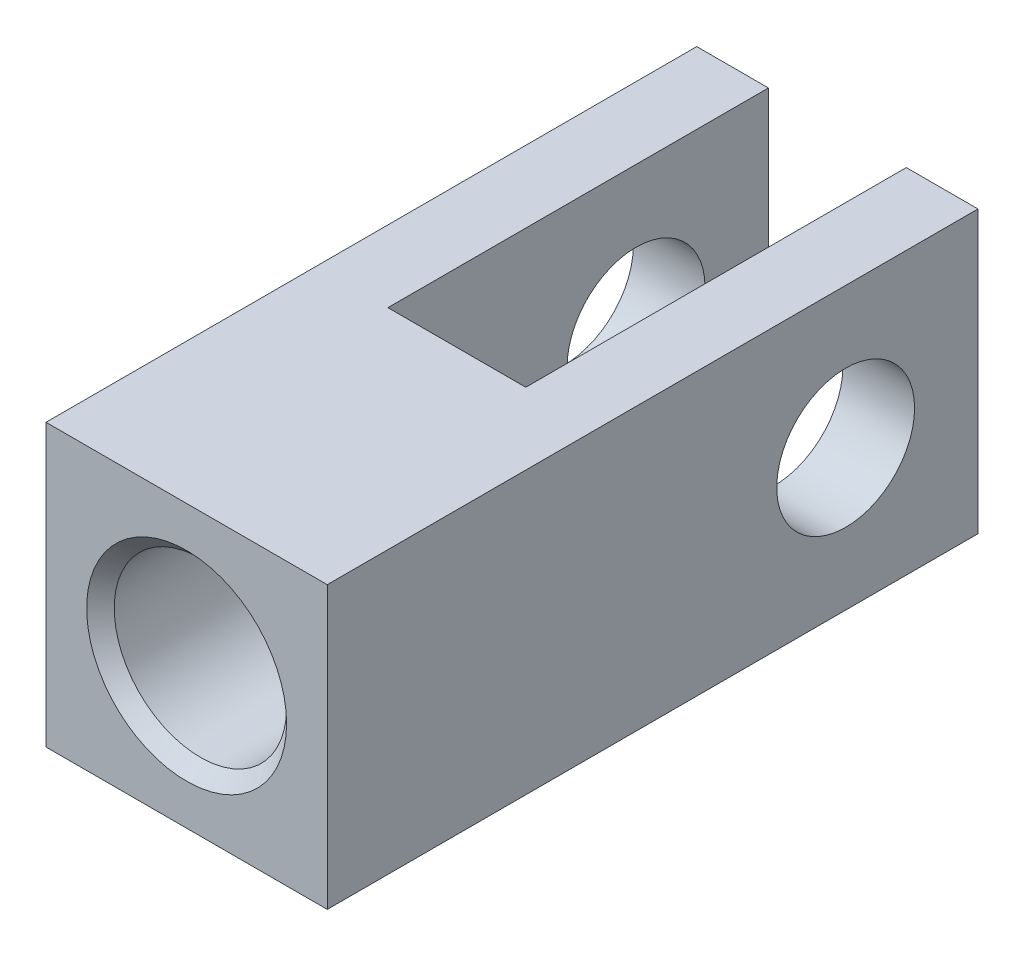
ISO-10303-21;
HEADER;
FILE_DESCRIPTION(('STEP AP214'),'2;1');
FILE_NAME('part.step','',(''),(''),'','','');
FILE_SCHEMA(('AUTOMOTIVE_DESIGN { 1 0 10303 214 1 1 1 1 }'));
ENDSEC;
DATA;
#1=APPLICATION_CONTEXT('core data for automotive mechanical design processes');
#2=APPLICATION_PROTOCOL_DEFINITION('international standard','automotive_design',2000,#1);
#3=PRODUCT_CONTEXT('',#1,'mechanical');
#4=PRODUCT('Part','Part','',(#3));
#5=PRODUCT_RELATED_PRODUCT_CATEGORY('part','',(#4));
#6=PRODUCT_DEFINITION_FORMATION('','',#4);
#7=PRODUCT_DEFINITION_CONTEXT('part definition',#1,'design');
#8=PRODUCT_DEFINITION('design','',#6,#7);
#9=PRODUCT_DEFINITION_SHAPE('','',#8);
#10=(LENGTH_UNIT() NAMED_UNIT(*) SI_UNIT(.MILLI.,.METRE.));
#11=(NAMED_UNIT(*) PLANE_ANGLE_UNIT() SI_UNIT($,.RADIAN.));
#12=(NAMED_UNIT(*) SI_UNIT($,.STERADIAN.) SOLID_ANGLE_UNIT());
#13=UNCERTAINTY_MEASURE_WITH_UNIT(LENGTH_MEASURE(1.E-05),#10,'distance_accuracy_value','');
#14=(GEOMETRIC_REPRESENTATION_CONTEXT(3) GLOBAL_UNCERTAINTY_ASSIGNED_CONTEXT((#13)) GLOBAL_UNIT_ASSIGNED_CONTEXT((#10,
#11,#12)) REPRESENTATION_CONTEXT('',''));
#15=CARTESIAN_POINT('',(0.,0.,0.));
#16=DIRECTION('',(0.,0.,1.));
#17=DIRECTION('',(1.,0.,0.));
#18=AXIS2_PLACEMENT_3D('',#15,#16,#17);
#19=CARTESIAN_POINT('',(-3.175,-6.477,2.54));
#20=DIRECTION('',(0.,0.,1.));
#21=DIRECTION('',(1.,0.,0.));
#22=AXIS2_PLACEMENT_3D('',#19,#20,#21);
#23=PLANE('',#22);
#24=DIRECTION('',(0.,1.,0.));
#25=VECTOR('',#24,1.);
#26=CARTESIAN_POINT('',(3.175,-6.477,2.54));
#27=LINE('',#26,#25);
#28=CARTESIAN_POINT('',(3.175,2.38124999999999,2.54));
#29=VERTEX_POINT('',#28);
#30=CARTESIAN_POINT('',(3.175,6.477,2.54));
#31=VERTEX_POINT('',#30);
#32=EDGE_CURVE('E126',#29,#31,#27,.T.);
#33=ORIENTED_EDGE('',*,*,#32,.F.);
#34=CARTESIAN_POINT('',(0.,0.,2.54));
#35=DIRECTION('',(0.,0.,1.));
#36=DIRECTION('',(1.,0.,0.));
#37=AXIS2_PLACEMENT_3D('',#34,#35,#36);
#38=CIRCLE('',#37,3.96875);
#39=CARTESIAN_POINT('',(-3.175,2.38125,2.54));
#40=VERTEX_POINT('',#39);
#41=EDGE_CURVE('E11',#29,#40,#38,.T.);
#42=ORIENTED_EDGE('',*,*,#41,.T.);
#43=DIRECTION('',(0.,1.,0.));
#44=VECTOR('',#43,1.);
#45=CARTESIAN_POINT('',(-3.175,-6.477,2.54));
#46=LINE('',#45,#44);
#47=CARTESIAN_POINT('',(-3.175,6.477,2.54));
#48=VERTEX_POINT('',#47);
#49=EDGE_CURVE('E141',#40,#48,#46,.T.);
#50=ORIENTED_EDGE('',*,*,#49,.T.);
#51=DIRECTION('',(1.,0.,0.));
#52=VECTOR('',#51,1.);
#53=CARTESIAN_POINT('',(-3.175,6.477,2.54));
#54=LINE('',#53,#52);
#55=EDGE_CURVE('E128',#48,#31,#54,.T.);
#56=ORIENTED_EDGE('',*,*,#55,.T.);
#57=EDGE_LOOP('',(#33,#42,#50,#56));
#58=FACE_BOUND('',#57,.T.);
#59=ADVANCED_FACE('F35',(#58),#23,.F.);
#60=CARTESIAN_POINT('',(6.477,6.477,-14.986));
#61=DIRECTION('',(0.,0.,1.));
#62=DIRECTION('',(1.,0.,0.));
#63=AXIS2_PLACEMENT_3D('',#60,#61,#62);
#64=PLANE('',#63);
#65=DIRECTION('',(-1.,0.,0.));
#66=VECTOR('',#65,1.);
#67=CARTESIAN_POINT('',(6.477,6.477,-14.986));
#68=LINE('',#67,#66);
#69=CARTESIAN_POINT('',(-3.175,6.477,-14.986));
#70=VERTEX_POINT('',#69);
#71=CARTESIAN_POINT('',(-6.477,6.477,-14.986));
#72=VERTEX_POINT('',#71);
#73=EDGE_CURVE('E150',#70,#72,#68,.T.);
#74=ORIENTED_EDGE('',*,*,#73,.F.);
#75=DIRECTION('',(0.,1.,0.));
#76=VECTOR('',#75,1.);
#77=CARTESIAN_POINT('',(-3.175,-6.477,-14.986));
#78=LINE('',#77,#76);
#79=CARTESIAN_POINT('',(-3.175,-6.477,-14.986));
#80=VERTEX_POINT('',#79);
#81=EDGE_CURVE('E159',#80,#70,#78,.T.);
#82=ORIENTED_EDGE('',*,*,#81,.F.);
#83=DIRECTION('',(-1.,0.,0.));
#84=VECTOR('',#83,1.);
#85=CARTESIAN_POINT('',(6.477,-6.477,-14.986));
#86=LINE('',#85,#84);
#87=CARTESIAN_POINT('',(-6.477,-6.477,-14.986));
#88=VERTEX_POINT('',#87);
#89=EDGE_CURVE('E163',#80,#88,#86,.T.);
#90=ORIENTED_EDGE('',*,*,#89,.T.);
#91=DIRECTION('',(0.,-1.,0.));
#92=VECTOR('',#91,1.);
#93=CARTESIAN_POINT('',(-6.477,6.477,-14.986));
#94=LINE('',#93,#92);
#95=EDGE_CURVE('E154',#72,#88,#94,.T.);
#96=ORIENTED_EDGE('',*,*,#95,.F.);
#97=EDGE_LOOP('',(#74,#82,#90,#96));
#98=FACE_BOUND('',#97,.T.);
#99=ADVANCED_FACE('F234',(#98),#64,.F.);
#100=CARTESIAN_POINT('',(-6.477,6.477,14.986));
#101=DIRECTION('',(1.,0.,0.));
#102=DIRECTION('',(0.,0.,-1.));
#103=AXIS2_PLACEMENT_3D('',#100,#101,#102);
#104=PLANE('',#103);
#105=CARTESIAN_POINT('',(-6.477,0.,-8.89));
#106=DIRECTION('',(1.,0.,0.));
#107=DIRECTION('',(0.,0.,-1.));
#108=AXIS2_PLACEMENT_3D('',#105,#106,#107);
#109=CIRCLE('',#108,3.175);
#110=CARTESIAN_POINT('',(-6.477,0.,-12.065));
#111=VERTEX_POINT('',#110);
#112=EDGE_CURVE('E179',#111,#111,#109,.T.);
#113=ORIENTED_EDGE('',*,*,#112,.T.);
#114=EDGE_LOOP('',(#113));
#115=FACE_BOUND('',#114,.T.);
#116=DIRECTION('',(0.,0.,1.));
#117=VECTOR('',#116,1.);
#118=CARTESIAN_POINT('',(-6.477,-6.477,14.986));
#119=LINE('',#118,#117);
#120=CARTESIAN_POINT('',(-6.477,-6.477,14.986));
#121=VERTEX_POINT('',#120);
#122=EDGE_CURVE('E155',#88,#121,#119,.T.);
#123=ORIENTED_EDGE('',*,*,#122,.T.);
#124=DIRECTION('',(0.,-1.,0.));
#125=VECTOR('',#124,1.);
#126=CARTESIAN_POINT('',(-6.477,6.477,14.986));
#127=LINE('',#126,#125);
#128=CARTESIAN_POINT('',(-6.477,6.477,14.986));
#129=VERTEX_POINT('',#128);
#130=EDGE_CURVE('E174',#129,#121,#127,.T.);
#131=ORIENTED_EDGE('',*,*,#130,.F.);
#132=DIRECTION('',(0.,0.,1.));
#133=VECTOR('',#132,1.);
#134=CARTESIAN_POINT('',(-6.477,6.477,14.986));
#135=LINE('',#134,#133);
#136=EDGE_CURVE('E142',#72,#129,#135,.T.);
#137=ORIENTED_EDGE('',*,*,#136,.F.);
#138=ORIENTED_EDGE('',*,*,#95,.T.);
#139=EDGE_LOOP('',(#123,#131,#137,#138));
#140=FACE_BOUND('',#139,.T.);
#141=ADVANCED_FACE('F37',(#115,#140),#104,.F.);
#142=CARTESIAN_POINT('',(6.477,6.477,14.986));
#143=DIRECTION('',(0.,0.,-1.));
#144=DIRECTION('',(-1.,0.,0.));
#145=AXIS2_PLACEMENT_3D('',#142,#143,#144);
#146=PLANE('',#145);
#147=CARTESIAN_POINT('',(0.,0.,14.986));
#148=DIRECTION('',(0.,0.,1.));
#149=DIRECTION('',(1.,0.,0.));
#150=AXIS2_PLACEMENT_3D('',#147,#148,#149);
#151=CIRCLE('',#150,4.60375);
#152=CARTESIAN_POINT('',(4.60375,0.,14.986));
#153=VERTEX_POINT('',#152);
#154=EDGE_CURVE('E385',#153,#153,#151,.T.);
#155=ORIENTED_EDGE('',*,*,#154,.F.);
#156=EDGE_LOOP('',(#155));
#157=FACE_BOUND('',#156,.T.);
#158=DIRECTION('',(1.,0.,0.));
#159=VECTOR('',#158,1.);
#160=CARTESIAN_POINT('',(6.477,-6.477,14.986));
#161=LINE('',#160,#159);
#162=CARTESIAN_POINT('',(6.477,-6.477,14.986));
#163=VERTEX_POINT('',#162);
#164=EDGE_CURVE('E158',#121,#163,#161,.T.);
#165=ORIENTED_EDGE('',*,*,#164,.T.);
#166=DIRECTION('',(0.,-1.,0.));
#167=VECTOR('',#166,1.);
#168=CARTESIAN_POINT('',(6.477,6.477,14.986));
#169=LINE('',#168,#167);
#170=CARTESIAN_POINT('',(6.477,6.477,14.986));
#171=VERTEX_POINT('',#170);
#172=EDGE_CURVE('E171',#171,#163,#169,.T.);
#173=ORIENTED_EDGE('',*,*,#172,.F.);
#174=DIRECTION('',(1.,0.,0.));
#175=VECTOR('',#174,1.);
#176=CARTESIAN_POINT('',(6.477,6.477,14.986));
#177=LINE('',#176,#175);
#178=EDGE_CURVE('E145',#129,#171,#177,.T.);
#179=ORIENTED_EDGE('',*,*,#178,.F.);
#180=ORIENTED_EDGE('',*,*,#130,.T.);
#181=EDGE_LOOP('',(#165,#173,#179,#180));
#182=FACE_BOUND('',#181,.T.);
#183=ADVANCED_FACE('F240',(#157,#182),#146,.F.);
#184=CARTESIAN_POINT('',(6.477,6.477,14.986));
#185=DIRECTION('',(-1.,0.,0.));
#186=DIRECTION('',(0.,0.,1.));
#187=AXIS2_PLACEMENT_3D('',#184,#185,#186);
#188=PLANE('',#187);
#189=CARTESIAN_POINT('',(6.477,0.,-8.89));
#190=DIRECTION('',(1.,0.,0.));
#191=DIRECTION('',(0.,0.,-1.));
#192=AXIS2_PLACEMENT_3D('',#189,#190,#191);
#193=CIRCLE('',#192,3.175);
#194=CARTESIAN_POINT('',(6.477,0.,-12.065));
#195=VERTEX_POINT('',#194);
#196=EDGE_CURVE('E123',#195,#195,#193,.T.);
#197=ORIENTED_EDGE('',*,*,#196,.F.);
#198=EDGE_LOOP('',(#197));
#199=FACE_BOUND('',#198,.T.);
#200=DIRECTION('',(0.,0.,-1.));
#201=VECTOR('',#200,1.);
#202=CARTESIAN_POINT('',(6.477,-6.477,14.986));
#203=LINE('',#202,#201);
#204=CARTESIAN_POINT('',(6.477,-6.477,-14.986));
#205=VERTEX_POINT('',#204);
#206=EDGE_CURVE('E161',#163,#205,#203,.T.);
#207=ORIENTED_EDGE('',*,*,#206,.T.);
#208=DIRECTION('',(0.,-1.,0.));
#209=VECTOR('',#208,1.);
#210=CARTESIAN_POINT('',(6.477,6.477,-14.986));
#211=LINE('',#210,#209);
#212=CARTESIAN_POINT('',(6.477,6.477,-14.986));
#213=VERTEX_POINT('',#212);
#214=EDGE_CURVE('E168',#213,#205,#211,.T.);
#215=ORIENTED_EDGE('',*,*,#214,.F.);
#216=DIRECTION('',(0.,0.,-1.));
#217=VECTOR('',#216,1.);
#218=CARTESIAN_POINT('',(6.477,6.477,14.986));
#219=LINE('',#218,#217);
#220=EDGE_CURVE('E148',#171,#213,#219,.T.);
#221=ORIENTED_EDGE('',*,*,#220,.F.);
#222=ORIENTED_EDGE('',*,*,#172,.T.);
#223=EDGE_LOOP('',(#207,#215,#221,#222));
#224=FACE_BOUND('',#223,.T.);
#225=ADVANCED_FACE('F218',(#199,#224),#188,.F.);
#226=CARTESIAN_POINT('',(3.175,-6.477,-14.986));
#227=VERTEX_POINT('',#226);
#228=EDGE_CURVE('E146',#205,#227,#86,.T.);
#229=ORIENTED_EDGE('',*,*,#228,.T.);
#230=DIRECTION('',(0.,1.,0.));
#231=VECTOR('',#230,1.);
#232=CARTESIAN_POINT('',(3.175,-6.477,-14.986));
#233=LINE('',#232,#231);
#234=CARTESIAN_POINT('',(3.175,6.477,-14.986));
#235=VERTEX_POINT('',#234);
#236=EDGE_CURVE('E134',#227,#235,#233,.T.);
#237=ORIENTED_EDGE('',*,*,#236,.T.);
#238=EDGE_CURVE('E151',#213,#235,#68,.T.);
#239=ORIENTED_EDGE('',*,*,#238,.F.);
#240=ORIENTED_EDGE('',*,*,#214,.T.);
#241=EDGE_LOOP('',(#229,#237,#239,#240));
#242=FACE_BOUND('',#241,.T.);
#243=ADVANCED_FACE('F210',(#242),#64,.F.);
#244=CARTESIAN_POINT('',(-6.477,6.477,-14.986));
#245=DIRECTION('',(0.,1.,0.));
#246=DIRECTION('',(0.,0.,1.));
#247=AXIS2_PLACEMENT_3D('',#244,#245,#246);
#248=PLANE('',#247);
#249=DIRECTION('',(0.,0.,1.));
#250=VECTOR('',#249,1.);
#251=CARTESIAN_POINT('',(-3.175,6.477,-14.986));
#252=LINE('',#251,#250);
#253=EDGE_CURVE('E183',#70,#48,#252,.T.);
#254=ORIENTED_EDGE('',*,*,#253,.F.);
#255=ORIENTED_EDGE('',*,*,#73,.T.);
#256=ORIENTED_EDGE('',*,*,#136,.T.);
#257=ORIENTED_EDGE('',*,*,#178,.T.);
#258=ORIENTED_EDGE('',*,*,#220,.T.);
#259=ORIENTED_EDGE('',*,*,#238,.T.);
#260=DIRECTION('',(0.,0.,-1.));
#261=VECTOR('',#260,1.);
#262=CARTESIAN_POINT('',(3.175,6.477,-14.986));
#263=LINE('',#262,#261);
#264=EDGE_CURVE('E197',#31,#235,#263,.T.);
#265=ORIENTED_EDGE('',*,*,#264,.F.);
#266=ORIENTED_EDGE('',*,*,#55,.F.);
#267=EDGE_LOOP('',(#254,#255,#256,#257,#258,#259,#265,#266));
#268=FACE_BOUND('',#267,.T.);
#269=ADVANCED_FACE('F213',(#268),#248,.T.);
#270=CARTESIAN_POINT('',(-6.477,-6.477,-14.986));
#271=DIRECTION('',(0.,1.,0.));
#272=DIRECTION('',(0.,0.,1.));
#273=AXIS2_PLACEMENT_3D('',#270,#271,#272);
#274=PLANE('',#273);
#275=ORIENTED_EDGE('',*,*,#89,.F.);
#276=DIRECTION('',(0.,0.,1.));
#277=VECTOR('',#276,1.);
#278=CARTESIAN_POINT('',(-3.175,-6.477,-14.986));
#279=LINE('',#278,#277);
#280=CARTESIAN_POINT('',(-3.175,-6.477,2.54));
#281=VERTEX_POINT('',#280);
#282=EDGE_CURVE('E193',#80,#281,#279,.T.);
#283=ORIENTED_EDGE('',*,*,#282,.T.);
#284=DIRECTION('',(1.,0.,0.));
#285=VECTOR('',#284,1.);
#286=CARTESIAN_POINT('',(-3.175,-6.477,2.54));
#287=LINE('',#286,#285);
#288=CARTESIAN_POINT('',(3.175,-6.477,2.54));
#289=VERTEX_POINT('',#288);
#290=EDGE_CURVE('E196',#281,#289,#287,.T.);
#291=ORIENTED_EDGE('',*,*,#290,.T.);
#292=DIRECTION('',(0.,0.,-1.));
#293=VECTOR('',#292,1.);
#294=CARTESIAN_POINT('',(3.175,-6.477,-14.986));
#295=LINE('',#294,#293);
#296=EDGE_CURVE('E58',#289,#227,#295,.T.);
#297=ORIENTED_EDGE('',*,*,#296,.T.);
#298=ORIENTED_EDGE('',*,*,#228,.F.);
#299=ORIENTED_EDGE('',*,*,#206,.F.);
#300=ORIENTED_EDGE('',*,*,#164,.F.);
#301=ORIENTED_EDGE('',*,*,#122,.F.);
#302=EDGE_LOOP('',(#275,#283,#291,#297,#298,#299,#300,#301));
#303=FACE_BOUND('',#302,.T.);
#304=ADVANCED_FACE('F222',(#303),#274,.F.);
#305=CARTESIAN_POINT('',(-3.175,-6.477,-14.986));
#306=DIRECTION('',(-1.,0.,0.));
#307=DIRECTION('',(0.,0.,1.));
#308=AXIS2_PLACEMENT_3D('',#305,#306,#307);
#309=PLANE('',#308);
#310=CARTESIAN_POINT('',(-3.175,0.,-8.89));
#311=DIRECTION('',(-1.,0.,0.));
#312=DIRECTION('',(0.,0.,1.));
#313=AXIS2_PLACEMENT_3D('',#310,#311,#312);
#314=CIRCLE('',#313,3.175);
#315=CARTESIAN_POINT('',(-3.175,0.,-5.715));
#316=VERTEX_POINT('',#315);
#317=EDGE_CURVE('E178',#316,#316,#314,.T.);
#318=ORIENTED_EDGE('',*,*,#317,.T.);
#319=EDGE_LOOP('',(#318));
#320=FACE_BOUND('',#319,.T.);
#321=ORIENTED_EDGE('',*,*,#253,.T.);
#322=ORIENTED_EDGE('',*,*,#49,.F.);
#323=CARTESIAN_POINT('',(-3.175,-2.38125,2.54));
#324=VERTEX_POINT('',#323);
#325=EDGE_CURVE('E140',#324,#40,#46,.T.);
#326=ORIENTED_EDGE('',*,*,#325,.F.);
#327=EDGE_CURVE('E130',#281,#324,#46,.T.);
#328=ORIENTED_EDGE('',*,*,#327,.F.);
#329=ORIENTED_EDGE('',*,*,#282,.F.);
#330=ORIENTED_EDGE('',*,*,#81,.T.);
#331=EDGE_LOOP('',(#321,#322,#326,#328,#329,#330));
#332=FACE_BOUND('',#331,.T.);
#333=ADVANCED_FACE('F230',(#320,#332),#309,.F.);
#334=CARTESIAN_POINT('',(3.175,-6.477,-14.986));
#335=DIRECTION('',(1.,0.,0.));
#336=DIRECTION('',(0.,0.,-1.));
#337=AXIS2_PLACEMENT_3D('',#334,#335,#336);
#338=PLANE('',#337);
#339=CARTESIAN_POINT('',(3.175,0.,-8.89));
#340=DIRECTION('',(1.,0.,0.));
#341=DIRECTION('',(0.,0.,-1.));
#342=AXIS2_PLACEMENT_3D('',#339,#340,#341);
#343=CIRCLE('',#342,3.175);
#344=CARTESIAN_POINT('',(3.175,0.,-12.065));
#345=VERTEX_POINT('',#344);
#346=EDGE_CURVE('E176',#345,#345,#343,.T.);
#347=ORIENTED_EDGE('',*,*,#346,.T.);
#348=EDGE_LOOP('',(#347));
#349=FACE_BOUND('',#348,.T.);
#350=ORIENTED_EDGE('',*,*,#264,.T.);
#351=ORIENTED_EDGE('',*,*,#236,.F.);
#352=ORIENTED_EDGE('',*,*,#296,.F.);
#353=CARTESIAN_POINT('',(3.175,-2.38124999999999,2.54));
#354=VERTEX_POINT('',#353);
#355=EDGE_CURVE('E132',#289,#354,#27,.T.);
#356=ORIENTED_EDGE('',*,*,#355,.T.);
#357=EDGE_CURVE('E122',#354,#29,#27,.T.);
#358=ORIENTED_EDGE('',*,*,#357,.T.);
#359=ORIENTED_EDGE('',*,*,#32,.T.);
#360=EDGE_LOOP('',(#350,#351,#352,#356,#358,#359));
#361=FACE_BOUND('',#360,.T.);
#362=ADVANCED_FACE('F133',(#349,#361),#338,.F.);
#363=ORIENTED_EDGE('',*,*,#327,.T.);
#364=EDGE_CURVE('E39',#324,#354,#38,.T.);
#365=ORIENTED_EDGE('',*,*,#364,.T.);
#366=ORIENTED_EDGE('',*,*,#355,.F.);
#367=ORIENTED_EDGE('',*,*,#290,.F.);
#368=EDGE_LOOP('',(#363,#365,#366,#367));
#369=FACE_BOUND('',#368,.T.);
#370=ADVANCED_FACE('F225',(#369),#23,.F.);
#371=CARTESIAN_POINT('',(-6.477,0.,-8.89));
#372=DIRECTION('',(1.,0.,0.));
#373=DIRECTION('',(0.,0.,-1.));
#374=AXIS2_PLACEMENT_3D('',#371,#372,#373);
#375=CYLINDRICAL_SURFACE('',#374,3.175);
#376=ORIENTED_EDGE('',*,*,#196,.T.);
#377=EDGE_LOOP('',(#376));
#378=FACE_BOUND('',#377,.T.);
#379=ORIENTED_EDGE('',*,*,#346,.F.);
#380=EDGE_LOOP('',(#379));
#381=FACE_BOUND('',#380,.T.);
#382=ADVANCED_FACE('F259',(#378,#381),#375,.F.);
#383=ORIENTED_EDGE('',*,*,#112,.F.);
#384=EDGE_LOOP('',(#383));
#385=FACE_BOUND('',#384,.T.);
#386=ORIENTED_EDGE('',*,*,#317,.F.);
#387=EDGE_LOOP('',(#386));
#388=FACE_BOUND('',#387,.T.);
#389=ADVANCED_FACE('F264',(#385,#388),#375,.F.);
#390=CARTESIAN_POINT('',(-3.175,-6.477,2.54));
#391=DIRECTION('',(0.,0.,1.));
#392=DIRECTION('',(1.,0.,0.));
#393=AXIS2_PLACEMENT_3D('',#390,#391,#392);
#394=PLANE('',#393);
#395=ORIENTED_EDGE('',*,*,#325,.T.);
#396=CARTESIAN_POINT('',(0.,0.,2.54));
#397=DIRECTION('',(0.,0.,1.));
#398=DIRECTION('',(1.,0.,0.));
#399=AXIS2_PLACEMENT_3D('',#396,#397,#398);
#400=CIRCLE('',#399,3.96875);
#401=EDGE_CURVE('E50',#324,#40,#400,.F.);
#402=ORIENTED_EDGE('',*,*,#401,.F.);
#403=EDGE_LOOP('',(#395,#402));
#404=FACE_BOUND('',#403,.T.);
#405=ADVANCED_FACE('F228',(#404),#394,.T.);
#406=CARTESIAN_POINT('',(0.,0.,14.986));
#407=DIRECTION('',(0.,0.,1.));
#408=DIRECTION('',(1.,0.,0.));
#409=AXIS2_PLACEMENT_3D('',#406,#407,#408);
#410=CYLINDRICAL_SURFACE('',#409,3.96875);
#411=ORIENTED_EDGE('',*,*,#401,.T.);
#412=ORIENTED_EDGE('',*,*,#41,.F.);
#413=EDGE_CURVE('E114',#29,#354,#400,.F.);
#414=ORIENTED_EDGE('',*,*,#413,.T.);
#415=ORIENTED_EDGE('',*,*,#364,.F.);
#416=EDGE_LOOP('',(#411,#412,#414,#415));
#417=FACE_BOUND('',#416,.T.);
#418=CARTESIAN_POINT('',(0.,0.,14.351));
#419=DIRECTION('',(0.,0.,1.));
#420=DIRECTION('',(1.,0.,0.));
#421=AXIS2_PLACEMENT_3D('',#418,#419,#420);
#422=CIRCLE('',#421,3.96875);
#423=CARTESIAN_POINT('',(3.96875,0.,14.351));
#424=VERTEX_POINT('',#423);
#425=EDGE_CURVE('E229',#424,#424,#422,.T.);
#426=ORIENTED_EDGE('',*,*,#425,.T.);
#427=EDGE_LOOP('',(#426));
#428=FACE_BOUND('',#427,.T.);
#429=ADVANCED_FACE('F112',(#417,#428),#410,.F.);
#430=CARTESIAN_POINT('',(0.,0.,14.986));
#431=DIRECTION('',(0.,0.,1.));
#432=DIRECTION('',(1.,0.,0.));
#433=AXIS2_PLACEMENT_3D('',#430,#431,#432);
#434=CONICAL_SURFACE('',#433,4.60375,0.785398163397448);
#435=ORIENTED_EDGE('',*,*,#425,.F.);
#436=EDGE_LOOP('',(#435));
#437=FACE_BOUND('',#436,.T.);
#438=ORIENTED_EDGE('',*,*,#154,.T.);
#439=EDGE_LOOP('',(#438));
#440=FACE_BOUND('',#439,.T.);
#441=ADVANCED_FACE('F276',(#437,#440),#434,.F.);
#442=ORIENTED_EDGE('',*,*,#413,.F.);
#443=ORIENTED_EDGE('',*,*,#357,.F.);
#444=EDGE_LOOP('',(#442,#443));
#445=FACE_BOUND('',#444,.T.);
#446=ADVANCED_FACE('F120',(#445),#394,.T.);
#447=CLOSED_SHELL('',(#59,#99,#141,#183,#225,#243,#269,#304,#333,#362,#370,#382,#389,#405,#429,
#441,#446));
#448=MANIFOLD_SOLID_BREP('B2',#447);
#449=ADVANCED_BREP_SHAPE_REPRESENTATION('',(#18,#448),#14);
#450=SHAPE_DEFINITION_REPRESENTATION(#9,#449);
ENDSEC;
END-ISO-10303-21;
